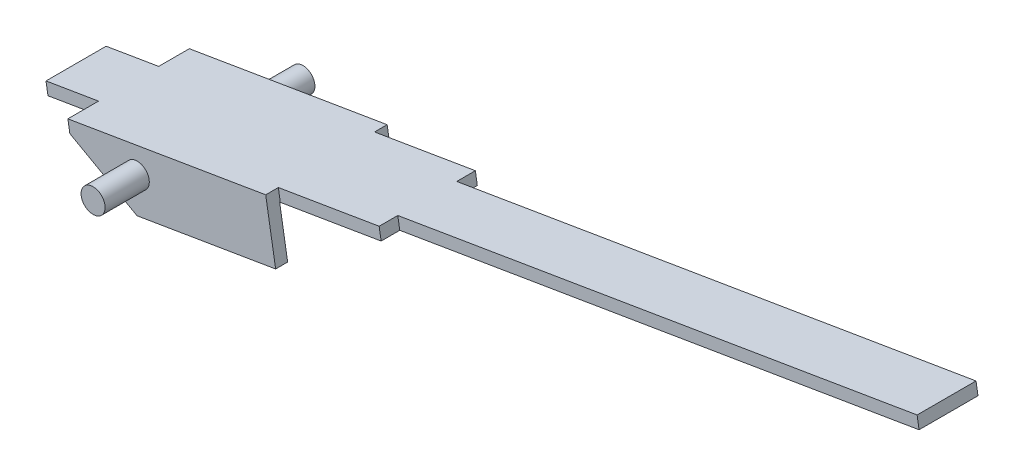
ISO-10303-21;
HEADER;
FILE_DESCRIPTION(('STEP AP214'),'2;1');
FILE_NAME('part.step','',(''),(''),'','','');
FILE_SCHEMA(('AUTOMOTIVE_DESIGN { 1 0 10303 214 1 1 1 1 }'));
ENDSEC;
DATA;
#1=APPLICATION_CONTEXT('core data for automotive mechanical design processes');
#2=APPLICATION_PROTOCOL_DEFINITION('international standard','automotive_design',2000,#1);
#3=PRODUCT_CONTEXT('',#1,'mechanical');
#4=PRODUCT('Part','Part','',(#3));
#5=PRODUCT_RELATED_PRODUCT_CATEGORY('part','',(#4));
#6=PRODUCT_DEFINITION_FORMATION('','',#4);
#7=PRODUCT_DEFINITION_CONTEXT('part definition',#1,'design');
#8=PRODUCT_DEFINITION('design','',#6,#7);
#9=PRODUCT_DEFINITION_SHAPE('','',#8);
#10=(LENGTH_UNIT() NAMED_UNIT(*) SI_UNIT(.MILLI.,.METRE.));
#11=(NAMED_UNIT(*) PLANE_ANGLE_UNIT() SI_UNIT($,.RADIAN.));
#12=(NAMED_UNIT(*) SI_UNIT($,.STERADIAN.) SOLID_ANGLE_UNIT());
#13=UNCERTAINTY_MEASURE_WITH_UNIT(LENGTH_MEASURE(1.E-05),#10,'distance_accuracy_value','');
#14=(GEOMETRIC_REPRESENTATION_CONTEXT(3) GLOBAL_UNCERTAINTY_ASSIGNED_CONTEXT((#13)) GLOBAL_UNIT_ASSIGNED_CONTEXT((#10,
#11,#12)) REPRESENTATION_CONTEXT('',''));
#15=CARTESIAN_POINT('',(0.,0.,0.));
#16=DIRECTION('',(0.,0.,1.));
#17=DIRECTION('',(1.,0.,0.));
#18=AXIS2_PLACEMENT_3D('',#15,#16,#17);
#19=CARTESIAN_POINT('',(63.0735162002673,7.61456197917017,5.05));
#20=DIRECTION('',(-0.165047605860671,0.986285601537233,0.));
#21=DIRECTION('',(-0.986285601537233,-0.165047605860671,0.));
#22=AXIS2_PLACEMENT_3D('',#19,#20,#21);
#23=PLANE('',#22);
#24=DIRECTION('',(0.986285601537233,0.165047605860671,0.));
#25=VECTOR('',#24,1.);
#26=CARTESIAN_POINT('',(63.0735162002673,7.61456197917017,5.05));
#27=LINE('',#26,#25);
#28=CARTESIAN_POINT('',(-0.0145047437726756,-2.94275204738829,5.05));
#29=VERTEX_POINT('',#28);
#30=CARTESIAN_POINT('',(11.5053110821822,-1.01499601093565,5.05));
#31=VERTEX_POINT('',#30);
#32=EDGE_CURVE('E175',#29,#31,#27,.T.);
#33=ORIENTED_EDGE('',*,*,#32,.F.);
#34=DIRECTION('',(0.,0.,1.));
#35=VECTOR('',#34,1.);
#36=CARTESIAN_POINT('',(-0.0145047437726756,-2.94275204738829,-8.725));
#37=LINE('',#36,#35);
#38=CARTESIAN_POINT('',(-0.0145047437726756,-2.94275204738829,4.05));
#39=VERTEX_POINT('',#38);
#40=EDGE_CURVE('E158',#39,#29,#37,.T.);
#41=ORIENTED_EDGE('',*,*,#40,.F.);
#42=DIRECTION('',(-0.986285601537233,-0.165047605860671,0.));
#43=VECTOR('',#42,1.);
#44=CARTESIAN_POINT('',(71.9834480449746,9.105573220801,4.05));
#45=LINE('',#44,#43);
#46=CARTESIAN_POINT('',(11.5053110821822,-1.01499601093568,4.05));
#47=VERTEX_POINT('',#46);
#48=EDGE_CURVE('E396',#47,#39,#45,.T.);
#49=ORIENTED_EDGE('',*,*,#48,.F.);
#50=DIRECTION('',(0.,0.,1.));
#51=VECTOR('',#50,1.);
#52=CARTESIAN_POINT('',(11.5053110821822,-1.01499601093565,5.05));
#53=LINE('',#52,#51);
#54=EDGE_CURVE('E181',#47,#31,#53,.T.);
#55=ORIENTED_EDGE('',*,*,#54,.T.);
#56=EDGE_LOOP('',(#33,#41,#49,#55));
#57=FACE_BOUND('',#56,.T.);
#58=ADVANCED_FACE('F16',(#57),#23,.F.);
#59=CARTESIAN_POINT('',(63.0735162002673,7.61456197917017,5.05));
#60=DIRECTION('',(0.,0.,-1.));
#61=DIRECTION('',(-1.,0.,0.));
#62=AXIS2_PLACEMENT_3D('',#59,#60,#61);
#63=PLANE('',#62);
#64=DIRECTION('',(0.165047605860671,-0.986285601537232,0.));
#65=VECTOR('',#64,1.);
#66=CARTESIAN_POINT('',(-4.94593275145883,-3.76799007669166,5.05));
#67=LINE('',#66,#65);
#68=CARTESIAN_POINT('',(-5.77117078076219,1.1634379309945,5.05));
#69=VERTEX_POINT('',#68);
#70=CARTESIAN_POINT('',(-5.60612317490151,0.177152329457265,5.05));
#71=VERTEX_POINT('',#70);
#72=EDGE_CURVE('E178',#69,#71,#67,.T.);
#73=ORIENTED_EDGE('',*,*,#72,.T.);
#74=DIRECTION('',(-0.873264085435059,0.487247203264699,0.));
#75=VECTOR('',#74,1.);
#76=CARTESIAN_POINT('',(-5.60612317490151,0.177152329457265,5.05));
#77=LINE('',#76,#75);
#78=EDGE_CURVE('E161',#29,#71,#77,.T.);
#79=ORIENTED_EDGE('',*,*,#78,.F.);
#80=ORIENTED_EDGE('',*,*,#32,.T.);
#81=DIRECTION('',(-0.165047605860671,0.986285601537232,0.));
#82=VECTOR('',#81,1.);
#83=CARTESIAN_POINT('',(11.5053110821822,-1.01499601093566,5.05));
#84=LINE('',#83,#82);
#85=CARTESIAN_POINT('',(10.6800730528788,3.9164319967505,5.05));
#86=VERTEX_POINT('',#85);
#87=EDGE_CURVE('E201',#31,#86,#84,.T.);
#88=ORIENTED_EDGE('',*,*,#87,.T.);
#89=DIRECTION('',(-0.986285601537232,-0.165047605860671,0.));
#90=VECTOR('',#89,1.);
#91=CARTESIAN_POINT('',(-10.1404159955721,0.432277037031721,5.05));
#92=LINE('',#91,#90);
#93=EDGE_CURVE('E184',#86,#69,#92,.T.);
#94=ORIENTED_EDGE('',*,*,#93,.T.);
#95=EDGE_LOOP('',(#73,#79,#80,#88,#94));
#96=FACE_BOUND('',#95,.T.);
#97=CARTESIAN_POINT('',(0.,0.,5.05));
#98=DIRECTION('',(0.,0.,-1.));
#99=DIRECTION('',(-1.,0.,0.));
#100=AXIS2_PLACEMENT_3D('',#97,#98,#99);
#101=CIRCLE('',#100,1.);
#102=CARTESIAN_POINT('',(-1.,0.,5.05));
#103=VERTEX_POINT('',#102);
#104=EDGE_CURVE('E203',#103,#103,#101,.F.);
#105=ORIENTED_EDGE('',*,*,#104,.F.);
#106=EDGE_LOOP('',(#105));
#107=FACE_BOUND('',#106,.T.);
#108=ADVANCED_FACE('F172',(#96,#107),#63,.F.);
#109=CARTESIAN_POINT('',(63.0735162002673,7.61456197917017,-5.05));
#110=DIRECTION('',(0.,0.,-1.));
#111=DIRECTION('',(-1.,0.,0.));
#112=AXIS2_PLACEMENT_3D('',#109,#110,#111);
#113=PLANE('',#112);
#114=DIRECTION('',(0.873264085435059,-0.487247203264699,0.));
#115=VECTOR('',#114,1.);
#116=CARTESIAN_POINT('',(43.6037099911584,-27.2800098087746,-5.05));
#117=LINE('',#116,#115);
#118=CARTESIAN_POINT('',(-5.60612317490151,0.177152329457265,-5.05));
#119=VERTEX_POINT('',#118);
#120=CARTESIAN_POINT('',(-0.0145047437726756,-2.94275204738829,-5.05));
#121=VERTEX_POINT('',#120);
#122=EDGE_CURVE('E407',#119,#121,#117,.T.);
#123=ORIENTED_EDGE('',*,*,#122,.F.);
#124=DIRECTION('',(0.165047605860671,-0.986285601537232,0.));
#125=VECTOR('',#124,1.);
#126=CARTESIAN_POINT('',(-4.94593275145883,-3.76799007669166,-5.05));
#127=LINE('',#126,#125);
#128=CARTESIAN_POINT('',(-5.77117078076218,1.1634379309945,-5.05));
#129=VERTEX_POINT('',#128);
#130=EDGE_CURVE('E197',#129,#119,#127,.T.);
#131=ORIENTED_EDGE('',*,*,#130,.F.);
#132=DIRECTION('',(-0.986285601537232,-0.165047605860671,0.));
#133=VECTOR('',#132,1.);
#134=CARTESIAN_POINT('',(-10.1404159955721,0.432277037031721,-5.05));
#135=LINE('',#134,#133);
#136=CARTESIAN_POINT('',(10.6800730528788,3.9164319967505,-5.05));
#137=VERTEX_POINT('',#136);
#138=EDGE_CURVE('E278',#137,#129,#135,.T.);
#139=ORIENTED_EDGE('',*,*,#138,.F.);
#140=DIRECTION('',(-0.165047605860671,0.986285601537232,0.));
#141=VECTOR('',#140,1.);
#142=CARTESIAN_POINT('',(11.5053110821822,-1.01499601093566,-5.05));
#143=LINE('',#142,#141);
#144=CARTESIAN_POINT('',(11.5053110821822,-1.01499601093565,-5.05));
#145=VERTEX_POINT('',#144);
#146=EDGE_CURVE('E195',#145,#137,#143,.T.);
#147=ORIENTED_EDGE('',*,*,#146,.F.);
#148=DIRECTION('',(0.986285601537233,0.165047605860671,0.));
#149=VECTOR('',#148,1.);
#150=CARTESIAN_POINT('',(63.0735162002673,7.61456197917017,-5.05));
#151=LINE('',#150,#149);
#152=EDGE_CURVE('E189',#121,#145,#151,.T.);
#153=ORIENTED_EDGE('',*,*,#152,.F.);
#154=EDGE_LOOP('',(#123,#131,#139,#147,#153));
#155=FACE_BOUND('',#154,.T.);
#156=CARTESIAN_POINT('',(0.,0.,-5.05));
#157=DIRECTION('',(0.,0.,-1.));
#158=DIRECTION('',(-1.,0.,0.));
#159=AXIS2_PLACEMENT_3D('',#156,#157,#158);
#160=CIRCLE('',#159,1.);
#161=CARTESIAN_POINT('',(-1.,0.,-5.05));
#162=VERTEX_POINT('',#161);
#163=EDGE_CURVE('E204',#162,#162,#160,.F.);
#164=ORIENTED_EDGE('',*,*,#163,.T.);
#165=EDGE_LOOP('',(#164));
#166=FACE_BOUND('',#165,.T.);
#167=ADVANCED_FACE('F295',(#155,#166),#113,.T.);
#168=CARTESIAN_POINT('',(62.2482781709639,12.5459899868563,5.05));
#169=DIRECTION('',(-0.986285601537233,-0.16504760586067,0.));
#170=DIRECTION('',(0.16504760586067,-0.986285601537233,0.));
#171=AXIS2_PLACEMENT_3D('',#168,#169,#170);
#172=PLANE('',#171);
#173=DIRECTION('',(-0.165047605860671,0.986285601537232,0.));
#174=VECTOR('',#173,1.);
#175=CARTESIAN_POINT('',(65.0454357846163,-4.16916480251072,2.45));
#176=LINE('',#175,#174);
#177=CARTESIAN_POINT('',(62.4133257768246,11.5597043853191,2.45));
#178=VERTEX_POINT('',#177);
#179=CARTESIAN_POINT('',(62.2482781709639,12.5459899868563,2.45));
#180=VERTEX_POINT('',#179);
#181=EDGE_CURVE('E227',#178,#180,#176,.T.);
#182=ORIENTED_EDGE('',*,*,#181,.F.);
#183=DIRECTION('',(0.,0.,1.));
#184=VECTOR('',#183,1.);
#185=CARTESIAN_POINT('',(62.4133257768246,11.5597043853191,4.05));
#186=LINE('',#185,#184);
#187=CARTESIAN_POINT('',(62.4133257768246,11.5597043853191,-2.45));
#188=VERTEX_POINT('',#187);
#189=EDGE_CURVE('E394',#188,#178,#186,.T.);
#190=ORIENTED_EDGE('',*,*,#189,.F.);
#191=DIRECTION('',(-0.165047605860671,0.986285601537232,0.));
#192=VECTOR('',#191,1.);
#193=CARTESIAN_POINT('',(65.0454357846163,-4.16916480251072,-2.45));
#194=LINE('',#193,#192);
#195=CARTESIAN_POINT('',(62.2482781709639,12.5459899868563,-2.45));
#196=VERTEX_POINT('',#195);
#197=EDGE_CURVE('E268',#188,#196,#194,.T.);
#198=ORIENTED_EDGE('',*,*,#197,.T.);
#199=DIRECTION('',(0.,0.,-1.));
#200=VECTOR('',#199,1.);
#201=CARTESIAN_POINT('',(62.2482781709639,12.5459899868563,5.05));
#202=LINE('',#201,#200);
#203=EDGE_CURVE('E187',#180,#196,#202,.T.);
#204=ORIENTED_EDGE('',*,*,#203,.F.);
#205=EDGE_LOOP('',(#182,#190,#198,#204));
#206=FACE_BOUND('',#205,.T.);
#207=ADVANCED_FACE('F18',(#206),#172,.F.);
#208=CARTESIAN_POINT('',(-10.1404159955721,0.432277037031721,5.05));
#209=DIRECTION('',(0.165047605860671,-0.986285601537232,0.));
#210=DIRECTION('',(0.986285601537233,0.165047605860671,0.));
#211=AXIS2_PLACEMENT_3D('',#208,#209,#210);
#212=PLANE('',#211);
#213=ORIENTED_EDGE('',*,*,#93,.F.);
#214=DIRECTION('',(0.,0.,1.));
#215=VECTOR('',#214,1.);
#216=CARTESIAN_POINT('',(10.6800730528788,3.9164319967505,4.));
#217=LINE('',#216,#215);
#218=CARTESIAN_POINT('',(10.6800730528788,3.9164319967505,4.));
#219=VERTEX_POINT('',#218);
#220=EDGE_CURVE('E225',#219,#86,#217,.T.);
#221=ORIENTED_EDGE('',*,*,#220,.F.);
#222=DIRECTION('',(-0.986285601537233,-0.165047605860671,0.));
#223=VECTOR('',#222,1.);
#224=CARTESIAN_POINT('',(19.0635006659453,5.3193366465662,4.));
#225=LINE('',#224,#223);
#226=CARTESIAN_POINT('',(19.0635006659453,5.3193366465662,4.));
#227=VERTEX_POINT('',#226);
#228=EDGE_CURVE('E222',#227,#219,#225,.T.);
#229=ORIENTED_EDGE('',*,*,#228,.F.);
#230=DIRECTION('',(0.,0.,1.));
#231=VECTOR('',#230,1.);
#232=CARTESIAN_POINT('',(19.0635006659453,5.3193366465662,2.45));
#233=LINE('',#232,#231);
#234=CARTESIAN_POINT('',(19.0635006659453,5.3193366465662,2.45));
#235=VERTEX_POINT('',#234);
#236=EDGE_CURVE('E219',#235,#227,#233,.T.);
#237=ORIENTED_EDGE('',*,*,#236,.F.);
#238=DIRECTION('',(-0.986285601537232,-0.165047605860671,0.));
#239=VECTOR('',#238,1.);
#240=CARTESIAN_POINT('',(62.2482781709639,12.5459899868563,2.45));
#241=LINE('',#240,#239);
#242=EDGE_CURVE('E206',#180,#235,#241,.T.);
#243=ORIENTED_EDGE('',*,*,#242,.F.);
#244=ORIENTED_EDGE('',*,*,#203,.T.);
#245=DIRECTION('',(0.986285601537232,0.165047605860671,0.));
#246=VECTOR('',#245,1.);
#247=CARTESIAN_POINT('',(62.2482781709639,12.5459899868563,-2.45));
#248=LINE('',#247,#246);
#249=CARTESIAN_POINT('',(19.0635006659453,5.3193366465662,-2.45));
#250=VERTEX_POINT('',#249);
#251=EDGE_CURVE('E264',#250,#196,#248,.T.);
#252=ORIENTED_EDGE('',*,*,#251,.F.);
#253=DIRECTION('',(0.,0.,1.));
#254=VECTOR('',#253,1.);
#255=CARTESIAN_POINT('',(19.0635006659453,5.3193366465662,-2.45));
#256=LINE('',#255,#254);
#257=CARTESIAN_POINT('',(19.0635006659453,5.3193366465662,-4.));
#258=VERTEX_POINT('',#257);
#259=EDGE_CURVE('E261',#258,#250,#256,.T.);
#260=ORIENTED_EDGE('',*,*,#259,.F.);
#261=DIRECTION('',(0.986285601537233,0.165047605860671,0.));
#262=VECTOR('',#261,1.);
#263=CARTESIAN_POINT('',(19.0635006659453,5.3193366465662,-4.));
#264=LINE('',#263,#262);
#265=CARTESIAN_POINT('',(10.6800730528788,3.9164319967505,-4.));
#266=VERTEX_POINT('',#265);
#267=EDGE_CURVE('E258',#266,#258,#264,.T.);
#268=ORIENTED_EDGE('',*,*,#267,.F.);
#269=DIRECTION('',(0.,0.,1.));
#270=VECTOR('',#269,1.);
#271=CARTESIAN_POINT('',(10.6800730528788,3.9164319967505,-4.));
#272=LINE('',#271,#270);
#273=EDGE_CURVE('E254',#137,#266,#272,.T.);
#274=ORIENTED_EDGE('',*,*,#273,.F.);
#275=ORIENTED_EDGE('',*,*,#138,.T.);
#276=DIRECTION('',(0.,0.,-1.));
#277=VECTOR('',#276,1.);
#278=CARTESIAN_POINT('',(-5.77117078076219,1.1634379309945,-2.5));
#279=LINE('',#278,#277);
#280=CARTESIAN_POINT('',(-5.77117078076219,1.1634379309945,-2.5));
#281=VERTEX_POINT('',#280);
#282=EDGE_CURVE('E249',#281,#129,#279,.T.);
#283=ORIENTED_EDGE('',*,*,#282,.F.);
#284=DIRECTION('',(0.986285601537233,0.165047605860671,0.));
#285=VECTOR('',#284,1.);
#286=CARTESIAN_POINT('',(-5.77117078076219,1.1634379309945,-2.5));
#287=LINE('',#286,#285);
#288=CARTESIAN_POINT('',(-10.1404159955721,0.432277037031723,-2.5));
#289=VERTEX_POINT('',#288);
#290=EDGE_CURVE('E245',#289,#281,#287,.T.);
#291=ORIENTED_EDGE('',*,*,#290,.F.);
#292=DIRECTION('',(0.,0.,-1.));
#293=VECTOR('',#292,1.);
#294=CARTESIAN_POINT('',(-10.1404159955721,0.432277037031721,5.05));
#295=LINE('',#294,#293);
#296=CARTESIAN_POINT('',(-10.1404159955721,0.432277037031723,2.5));
#297=VERTEX_POINT('',#296);
#298=EDGE_CURVE('E183',#297,#289,#295,.T.);
#299=ORIENTED_EDGE('',*,*,#298,.F.);
#300=DIRECTION('',(-0.986285601537233,-0.165047605860671,0.));
#301=VECTOR('',#300,1.);
#302=CARTESIAN_POINT('',(-5.77117078076219,1.1634379309945,2.5));
#303=LINE('',#302,#301);
#304=CARTESIAN_POINT('',(-5.77117078076219,1.1634379309945,2.5));
#305=VERTEX_POINT('',#304);
#306=EDGE_CURVE('E239',#305,#297,#303,.T.);
#307=ORIENTED_EDGE('',*,*,#306,.F.);
#308=DIRECTION('',(0.,0.,-1.));
#309=VECTOR('',#308,1.);
#310=CARTESIAN_POINT('',(-5.77117078076219,1.1634379309945,5.05));
#311=LINE('',#310,#309);
#312=EDGE_CURVE('E236',#69,#305,#311,.T.);
#313=ORIENTED_EDGE('',*,*,#312,.F.);
#314=EDGE_LOOP('',(#213,#221,#229,#237,#243,#244,#252,#260,#268,#274,#275,#283,#291,#299,#307,#313));
#315=FACE_BOUND('',#314,.T.);
#316=ADVANCED_FACE('F301',(#315),#212,.F.);
#317=CARTESIAN_POINT('',(-9.31517796626878,-4.49915097065442,5.05));
#318=DIRECTION('',(0.986285601537233,0.165047605860671,0.));
#319=DIRECTION('',(-0.165047605860671,0.986285601537233,0.));
#320=AXIS2_PLACEMENT_3D('',#317,#318,#319);
#321=PLANE('',#320);
#322=DIRECTION('',(-0.165047605860671,0.986285601537232,0.));
#323=VECTOR('',#322,1.);
#324=CARTESIAN_POINT('',(-7.34325838191977,-16.2828777523354,-2.5));
#325=LINE('',#324,#323);
#326=CARTESIAN_POINT('',(-9.97536838971146,-0.554008564505507,-2.5));
#327=VERTEX_POINT('',#326);
#328=EDGE_CURVE('E251',#327,#289,#325,.T.);
#329=ORIENTED_EDGE('',*,*,#328,.F.);
#330=DIRECTION('',(0.,0.,-1.));
#331=VECTOR('',#330,1.);
#332=CARTESIAN_POINT('',(-9.97536838971146,-0.554008564505507,4.05));
#333=LINE('',#332,#331);
#334=CARTESIAN_POINT('',(-9.97536838971146,-0.554008564505507,2.5));
#335=VERTEX_POINT('',#334);
#336=EDGE_CURVE('E369',#335,#327,#333,.T.);
#337=ORIENTED_EDGE('',*,*,#336,.F.);
#338=DIRECTION('',(-0.165047605860671,0.986285601537232,0.));
#339=VECTOR('',#338,1.);
#340=CARTESIAN_POINT('',(-7.34325838191977,-16.2828777523354,2.5));
#341=LINE('',#340,#339);
#342=EDGE_CURVE('E243',#335,#297,#341,.T.);
#343=ORIENTED_EDGE('',*,*,#342,.T.);
#344=ORIENTED_EDGE('',*,*,#298,.T.);
#345=EDGE_LOOP('',(#329,#337,#343,#344));
#346=FACE_BOUND('',#345,.T.);
#347=ADVANCED_FACE('F355',(#346),#321,.F.);
#348=DIRECTION('',(-0.986285601537233,-0.165047605860671,0.));
#349=VECTOR('',#348,1.);
#350=CARTESIAN_POINT('',(71.9834480449746,9.105573220801,-4.05));
#351=LINE('',#350,#349);
#352=CARTESIAN_POINT('',(11.5053110821822,-1.01499601093568,-4.05));
#353=VERTEX_POINT('',#352);
#354=CARTESIAN_POINT('',(-0.0145047437726808,-2.94275204738832,-4.05));
#355=VERTEX_POINT('',#354);
#356=EDGE_CURVE('E403',#353,#355,#351,.T.);
#357=ORIENTED_EDGE('',*,*,#356,.T.);
#358=EDGE_CURVE('E31',#121,#355,#37,.T.);
#359=ORIENTED_EDGE('',*,*,#358,.F.);
#360=ORIENTED_EDGE('',*,*,#152,.T.);
#361=DIRECTION('',(0.,0.,1.));
#362=VECTOR('',#361,1.);
#363=CARTESIAN_POINT('',(11.5053110821822,-1.01499601093565,5.05));
#364=LINE('',#363,#362);
#365=EDGE_CURVE('E270',#145,#353,#364,.T.);
#366=ORIENTED_EDGE('',*,*,#365,.T.);
#367=EDGE_LOOP('',(#357,#359,#360,#366));
#368=FACE_BOUND('',#367,.T.);
#369=ADVANCED_FACE('F284',(#368),#23,.F.);
#370=CARTESIAN_POINT('',(65.0454357846163,-4.16916480251072,-2.45));
#371=DIRECTION('',(0.,0.,1.));
#372=DIRECTION('',(1.,0.,0.));
#373=AXIS2_PLACEMENT_3D('',#370,#371,#372);
#374=PLANE('',#373);
#375=ORIENTED_EDGE('',*,*,#197,.F.);
#376=DIRECTION('',(-0.986285601537233,-0.165047605860671,0.));
#377=VECTOR('',#376,1.);
#378=CARTESIAN_POINT('',(62.4133257768246,11.5597043853191,-2.45));
#379=LINE('',#378,#377);
#380=CARTESIAN_POINT('',(19.228548271806,4.33305104502895,-2.45));
#381=VERTEX_POINT('',#380);
#382=EDGE_CURVE('E315',#188,#381,#379,.T.);
#383=ORIENTED_EDGE('',*,*,#382,.T.);
#384=DIRECTION('',(-0.165047605860671,0.986285601537232,0.));
#385=VECTOR('',#384,1.);
#386=CARTESIAN_POINT('',(21.8606582795977,-11.3958181428008,-2.45));
#387=LINE('',#386,#385);
#388=EDGE_CURVE('E271',#381,#250,#387,.T.);
#389=ORIENTED_EDGE('',*,*,#388,.T.);
#390=ORIENTED_EDGE('',*,*,#251,.T.);
#391=EDGE_LOOP('',(#375,#383,#389,#390));
#392=FACE_BOUND('',#391,.T.);
#393=ADVANCED_FACE('F354',(#392),#374,.F.);
#394=CARTESIAN_POINT('',(21.8606582795977,-11.3958181428008,-2.45));
#395=DIRECTION('',(-0.986285601537232,-0.165047605860671,0.));
#396=DIRECTION('',(0.165047605860671,-0.986285601537232,0.));
#397=AXIS2_PLACEMENT_3D('',#394,#395,#396);
#398=PLANE('',#397);
#399=ORIENTED_EDGE('',*,*,#388,.F.);
#400=DIRECTION('',(0.,0.,-1.));
#401=VECTOR('',#400,1.);
#402=CARTESIAN_POINT('',(19.228548271806,4.33305104502895,-2.45));
#403=LINE('',#402,#401);
#404=CARTESIAN_POINT('',(19.228548271806,4.33305104502895,-4.));
#405=VERTEX_POINT('',#404);
#406=EDGE_CURVE('E313',#381,#405,#403,.T.);
#407=ORIENTED_EDGE('',*,*,#406,.T.);
#408=DIRECTION('',(-0.165047605860671,0.986285601537232,0.));
#409=VECTOR('',#408,1.);
#410=CARTESIAN_POINT('',(21.8606582795977,-11.3958181428008,-4.));
#411=LINE('',#410,#409);
#412=EDGE_CURVE('E273',#405,#258,#411,.T.);
#413=ORIENTED_EDGE('',*,*,#412,.T.);
#414=ORIENTED_EDGE('',*,*,#259,.T.);
#415=EDGE_LOOP('',(#399,#407,#413,#414));
#416=FACE_BOUND('',#415,.T.);
#417=ADVANCED_FACE('F360',(#416),#398,.F.);
#418=CARTESIAN_POINT('',(21.8606582795977,-11.3958181428008,-4.));
#419=DIRECTION('',(0.,0.,1.));
#420=DIRECTION('',(1.,0.,0.));
#421=AXIS2_PLACEMENT_3D('',#418,#419,#420);
#422=PLANE('',#421);
#423=ORIENTED_EDGE('',*,*,#412,.F.);
#424=DIRECTION('',(-0.986285601537233,-0.165047605860671,0.));
#425=VECTOR('',#424,1.);
#426=CARTESIAN_POINT('',(19.228548271806,4.33305104502895,-4.));
#427=LINE('',#426,#425);
#428=CARTESIAN_POINT('',(10.8451206587395,2.93014639521326,-4.));
#429=VERTEX_POINT('',#428);
#430=EDGE_CURVE('E311',#405,#429,#427,.T.);
#431=ORIENTED_EDGE('',*,*,#430,.T.);
#432=DIRECTION('',(-0.165047605860671,0.986285601537232,0.));
#433=VECTOR('',#432,1.);
#434=CARTESIAN_POINT('',(13.4772306665312,-12.7987227926166,-4.));
#435=LINE('',#434,#433);
#436=EDGE_CURVE('E267',#429,#266,#435,.T.);
#437=ORIENTED_EDGE('',*,*,#436,.T.);
#438=ORIENTED_EDGE('',*,*,#267,.T.);
#439=EDGE_LOOP('',(#423,#431,#437,#438));
#440=FACE_BOUND('',#439,.T.);
#441=ADVANCED_FACE('F310',(#440),#422,.F.);
#442=CARTESIAN_POINT('',(13.4772306665312,-12.7987227926166,-4.));
#443=DIRECTION('',(-0.986285601537232,-0.165047605860671,0.));
#444=DIRECTION('',(0.165047605860671,-0.986285601537232,0.));
#445=AXIS2_PLACEMENT_3D('',#442,#443,#444);
#446=PLANE('',#445);
#447=DIRECTION('',(0.,0.,-1.));
#448=VECTOR('',#447,1.);
#449=CARTESIAN_POINT('',(10.8451206587395,2.93014639521326,-4.));
#450=LINE('',#449,#448);
#451=CARTESIAN_POINT('',(10.8451206587395,2.93014639521326,-4.05));
#452=VERTEX_POINT('',#451);
#453=EDGE_CURVE('E306',#429,#452,#450,.T.);
#454=ORIENTED_EDGE('',*,*,#453,.T.);
#455=DIRECTION('',(0.165047605860671,-0.986285601537233,0.));
#456=VECTOR('',#455,1.);
#457=CARTESIAN_POINT('',(13.4772306665312,-12.7987227926166,-4.05));
#458=LINE('',#457,#456);
#459=EDGE_CURVE('E293',#452,#353,#458,.T.);
#460=ORIENTED_EDGE('',*,*,#459,.T.);
#461=ORIENTED_EDGE('',*,*,#365,.F.);
#462=ORIENTED_EDGE('',*,*,#146,.T.);
#463=ORIENTED_EDGE('',*,*,#273,.T.);
#464=ORIENTED_EDGE('',*,*,#436,.F.);
#465=EDGE_LOOP('',(#454,#460,#461,#462,#463,#464));
#466=FACE_BOUND('',#465,.T.);
#467=ADVANCED_FACE('F291',(#466),#446,.F.);
#468=CARTESIAN_POINT('',(-2.97401316710982,-15.5517168583725,-2.5));
#469=DIRECTION('',(0.,0.,1.));
#470=DIRECTION('',(1.,0.,0.));
#471=AXIS2_PLACEMENT_3D('',#468,#469,#470);
#472=PLANE('',#471);
#473=DIRECTION('',(-0.165047605860671,0.986285601537232,0.));
#474=VECTOR('',#473,1.);
#475=CARTESIAN_POINT('',(-2.97401316710982,-15.5517168583725,-2.5));
#476=LINE('',#475,#474);
#477=CARTESIAN_POINT('',(-5.60612317490152,0.177152329457267,-2.5));
#478=VERTEX_POINT('',#477);
#479=EDGE_CURVE('E252',#478,#281,#476,.T.);
#480=ORIENTED_EDGE('',*,*,#479,.F.);
#481=DIRECTION('',(-0.986285601537233,-0.165047605860671,0.));
#482=VECTOR('',#481,1.);
#483=CARTESIAN_POINT('',(-5.60612317490151,0.177152329457267,-2.5));
#484=LINE('',#483,#482);
#485=EDGE_CURVE('E317',#478,#327,#484,.T.);
#486=ORIENTED_EDGE('',*,*,#485,.T.);
#487=ORIENTED_EDGE('',*,*,#328,.T.);
#488=ORIENTED_EDGE('',*,*,#290,.T.);
#489=EDGE_LOOP('',(#480,#486,#487,#488));
#490=FACE_BOUND('',#489,.T.);
#491=ADVANCED_FACE('F375',(#490),#472,.F.);
#492=CARTESIAN_POINT('',(-2.97401316710982,-15.5517168583725,-2.5));
#493=DIRECTION('',(0.986285601537232,0.165047605860671,0.));
#494=DIRECTION('',(-0.165047605860671,0.986285601537232,0.));
#495=AXIS2_PLACEMENT_3D('',#492,#493,#494);
#496=PLANE('',#495);
#497=ORIENTED_EDGE('',*,*,#130,.T.);
#498=DIRECTION('',(0.,0.,1.));
#499=VECTOR('',#498,1.);
#500=CARTESIAN_POINT('',(-5.60612317490151,0.177152329457265,-8.725));
#501=LINE('',#500,#499);
#502=CARTESIAN_POINT('',(-5.60612317490151,0.177152329457265,-4.05));
#503=VERTEX_POINT('',#502);
#504=EDGE_CURVE('E411',#119,#503,#501,.T.);
#505=ORIENTED_EDGE('',*,*,#504,.T.);
#506=DIRECTION('',(0.,0.,1.));
#507=VECTOR('',#506,1.);
#508=CARTESIAN_POINT('',(-5.60612317490152,0.177152329457267,-2.5));
#509=LINE('',#508,#507);
#510=EDGE_CURVE('E378',#503,#478,#509,.T.);
#511=ORIENTED_EDGE('',*,*,#510,.T.);
#512=ORIENTED_EDGE('',*,*,#479,.T.);
#513=ORIENTED_EDGE('',*,*,#282,.T.);
#514=EDGE_LOOP('',(#497,#505,#511,#512,#513));
#515=FACE_BOUND('',#514,.T.);
#516=ADVANCED_FACE('F417',(#515),#496,.F.);
#517=CARTESIAN_POINT('',(-2.97401316710982,-15.5517168583725,2.5));
#518=DIRECTION('',(0.,0.,-1.));
#519=DIRECTION('',(-1.,0.,0.));
#520=AXIS2_PLACEMENT_3D('',#517,#518,#519);
#521=PLANE('',#520);
#522=ORIENTED_EDGE('',*,*,#342,.F.);
#523=DIRECTION('',(0.986285601537233,0.165047605860671,0.));
#524=VECTOR('',#523,1.);
#525=CARTESIAN_POINT('',(-5.60612317490151,0.177152329457267,2.5));
#526=LINE('',#525,#524);
#527=CARTESIAN_POINT('',(-5.60612317490152,0.177152329457267,2.5));
#528=VERTEX_POINT('',#527);
#529=EDGE_CURVE('E379',#335,#528,#526,.T.);
#530=ORIENTED_EDGE('',*,*,#529,.T.);
#531=DIRECTION('',(-0.165047605860671,0.986285601537232,0.));
#532=VECTOR('',#531,1.);
#533=CARTESIAN_POINT('',(-2.97401316710982,-15.5517168583725,2.5));
#534=LINE('',#533,#532);
#535=EDGE_CURVE('E242',#528,#305,#534,.T.);
#536=ORIENTED_EDGE('',*,*,#535,.T.);
#537=ORIENTED_EDGE('',*,*,#306,.T.);
#538=EDGE_LOOP('',(#522,#530,#536,#537));
#539=FACE_BOUND('',#538,.T.);
#540=ADVANCED_FACE('F458',(#539),#521,.F.);
#541=CARTESIAN_POINT('',(-2.97401316710982,-15.5517168583725,5.05));
#542=DIRECTION('',(0.986285601537232,0.165047605860671,0.));
#543=DIRECTION('',(-0.165047605860671,0.986285601537232,0.));
#544=AXIS2_PLACEMENT_3D('',#541,#542,#543);
#545=PLANE('',#544);
#546=DIRECTION('',(0.,0.,1.));
#547=VECTOR('',#546,1.);
#548=CARTESIAN_POINT('',(-5.60612317490152,0.177152329457267,5.05));
#549=LINE('',#548,#547);
#550=CARTESIAN_POINT('',(-5.60612317490151,0.177152329457267,4.05));
#551=VERTEX_POINT('',#550);
#552=EDGE_CURVE('E384',#528,#551,#549,.T.);
#553=ORIENTED_EDGE('',*,*,#552,.T.);
#554=EDGE_CURVE('E413',#551,#71,#501,.T.);
#555=ORIENTED_EDGE('',*,*,#554,.T.);
#556=ORIENTED_EDGE('',*,*,#72,.F.);
#557=ORIENTED_EDGE('',*,*,#312,.T.);
#558=ORIENTED_EDGE('',*,*,#535,.F.);
#559=EDGE_LOOP('',(#553,#555,#556,#557,#558));
#560=FACE_BOUND('',#559,.T.);
#561=ADVANCED_FACE('F453',(#560),#545,.F.);
#562=CARTESIAN_POINT('',(21.8606582795977,-11.3958181428008,4.));
#563=DIRECTION('',(0.,0.,-1.));
#564=DIRECTION('',(-1.,0.,0.));
#565=AXIS2_PLACEMENT_3D('',#562,#563,#564);
#566=PLANE('',#565);
#567=DIRECTION('',(-0.165047605860671,0.986285601537232,0.));
#568=VECTOR('',#567,1.);
#569=CARTESIAN_POINT('',(13.4772306665312,-12.7987227926166,4.));
#570=LINE('',#569,#568);
#571=CARTESIAN_POINT('',(10.8451206587395,2.93014639521326,4.));
#572=VERTEX_POINT('',#571);
#573=EDGE_CURVE('E228',#572,#219,#570,.T.);
#574=ORIENTED_EDGE('',*,*,#573,.F.);
#575=DIRECTION('',(0.986285601537233,0.165047605860671,0.));
#576=VECTOR('',#575,1.);
#577=CARTESIAN_POINT('',(19.228548271806,4.33305104502895,4.));
#578=LINE('',#577,#576);
#579=CARTESIAN_POINT('',(19.228548271806,4.33305104502895,4.));
#580=VERTEX_POINT('',#579);
#581=EDGE_CURVE('E39',#572,#580,#578,.T.);
#582=ORIENTED_EDGE('',*,*,#581,.T.);
#583=DIRECTION('',(-0.165047605860671,0.986285601537232,0.));
#584=VECTOR('',#583,1.);
#585=CARTESIAN_POINT('',(21.8606582795977,-11.3958181428008,4.));
#586=LINE('',#585,#584);
#587=EDGE_CURVE('E230',#580,#227,#586,.T.);
#588=ORIENTED_EDGE('',*,*,#587,.T.);
#589=ORIENTED_EDGE('',*,*,#228,.T.);
#590=EDGE_LOOP('',(#574,#582,#588,#589));
#591=FACE_BOUND('',#590,.T.);
#592=ADVANCED_FACE('F450',(#591),#566,.F.);
#593=CARTESIAN_POINT('',(21.8606582795977,-11.3958181428008,2.45));
#594=DIRECTION('',(-0.986285601537232,-0.165047605860671,0.));
#595=DIRECTION('',(0.165047605860671,-0.986285601537232,0.));
#596=AXIS2_PLACEMENT_3D('',#593,#594,#595);
#597=PLANE('',#596);
#598=ORIENTED_EDGE('',*,*,#587,.F.);
#599=DIRECTION('',(0.,0.,-1.));
#600=VECTOR('',#599,1.);
#601=CARTESIAN_POINT('',(19.228548271806,4.33305104502895,2.45));
#602=LINE('',#601,#600);
#603=CARTESIAN_POINT('',(19.228548271806,4.33305104502895,2.45));
#604=VERTEX_POINT('',#603);
#605=EDGE_CURVE('E390',#580,#604,#602,.T.);
#606=ORIENTED_EDGE('',*,*,#605,.T.);
#607=DIRECTION('',(-0.165047605860671,0.986285601537232,0.));
#608=VECTOR('',#607,1.);
#609=CARTESIAN_POINT('',(21.8606582795977,-11.3958181428008,2.45));
#610=LINE('',#609,#608);
#611=EDGE_CURVE('E232',#604,#235,#610,.T.);
#612=ORIENTED_EDGE('',*,*,#611,.T.);
#613=ORIENTED_EDGE('',*,*,#236,.T.);
#614=EDGE_LOOP('',(#598,#606,#612,#613));
#615=FACE_BOUND('',#614,.T.);
#616=ADVANCED_FACE('F446',(#615),#597,.F.);
#617=CARTESIAN_POINT('',(65.0454357846163,-4.16916480251072,2.45));
#618=DIRECTION('',(0.,0.,-1.));
#619=DIRECTION('',(-1.,0.,0.));
#620=AXIS2_PLACEMENT_3D('',#617,#618,#619);
#621=PLANE('',#620);
#622=ORIENTED_EDGE('',*,*,#611,.F.);
#623=DIRECTION('',(0.986285601537233,0.165047605860671,0.));
#624=VECTOR('',#623,1.);
#625=CARTESIAN_POINT('',(62.4133257768246,11.5597043853191,2.45));
#626=LINE('',#625,#624);
#627=EDGE_CURVE('E387',#604,#178,#626,.T.);
#628=ORIENTED_EDGE('',*,*,#627,.T.);
#629=ORIENTED_EDGE('',*,*,#181,.T.);
#630=ORIENTED_EDGE('',*,*,#242,.T.);
#631=EDGE_LOOP('',(#622,#628,#629,#630));
#632=FACE_BOUND('',#631,.T.);
#633=ADVANCED_FACE('F442',(#632),#621,.F.);
#634=CARTESIAN_POINT('',(13.4772306665312,-12.7987227926166,4.));
#635=DIRECTION('',(-0.986285601537232,-0.165047605860671,0.));
#636=DIRECTION('',(0.165047605860671,-0.986285601537232,0.));
#637=AXIS2_PLACEMENT_3D('',#634,#635,#636);
#638=PLANE('',#637);
#639=ORIENTED_EDGE('',*,*,#54,.F.);
#640=DIRECTION('',(-0.165047605860671,0.986285601537233,0.));
#641=VECTOR('',#640,1.);
#642=CARTESIAN_POINT('',(13.4772306665312,-12.7987227926166,4.05));
#643=LINE('',#642,#641);
#644=CARTESIAN_POINT('',(10.8451206587395,2.93014639521326,4.05));
#645=VERTEX_POINT('',#644);
#646=EDGE_CURVE('E10',#47,#645,#643,.T.);
#647=ORIENTED_EDGE('',*,*,#646,.T.);
#648=DIRECTION('',(0.,0.,-1.));
#649=VECTOR('',#648,1.);
#650=CARTESIAN_POINT('',(10.8451206587395,2.93014639521326,4.));
#651=LINE('',#650,#649);
#652=EDGE_CURVE('E24',#645,#572,#651,.T.);
#653=ORIENTED_EDGE('',*,*,#652,.T.);
#654=ORIENTED_EDGE('',*,*,#573,.T.);
#655=ORIENTED_EDGE('',*,*,#220,.T.);
#656=ORIENTED_EDGE('',*,*,#87,.F.);
#657=EDGE_LOOP('',(#639,#647,#653,#654,#655,#656));
#658=FACE_BOUND('',#657,.T.);
#659=ADVANCED_FACE('F437',(#658),#638,.F.);
#660=CARTESIAN_POINT('',(0.,0.,-8.725));
#661=DIRECTION('',(0.,0.,1.));
#662=DIRECTION('',(1.,0.,0.));
#663=AXIS2_PLACEMENT_3D('',#660,#661,#662);
#664=PLANE('',#663);
#665=CARTESIAN_POINT('',(0.,0.,-8.725));
#666=DIRECTION('',(0.,0.,1.));
#667=DIRECTION('',(1.,0.,0.));
#668=AXIS2_PLACEMENT_3D('',#665,#666,#667);
#669=CIRCLE('',#668,1.);
#670=CARTESIAN_POINT('',(1.,0.,-8.725));
#671=VERTEX_POINT('',#670);
#672=EDGE_CURVE('E323',#671,#671,#669,.T.);
#673=ORIENTED_EDGE('',*,*,#672,.F.);
#674=EDGE_LOOP('',(#673));
#675=FACE_BOUND('',#674,.T.);
#676=ADVANCED_FACE('F343',(#675),#664,.F.);
#677=CARTESIAN_POINT('',(0.,0.,8.725));
#678=DIRECTION('',(0.,0.,-1.));
#679=DIRECTION('',(-1.,0.,0.));
#680=AXIS2_PLACEMENT_3D('',#677,#678,#679);
#681=CYLINDRICAL_SURFACE('',#680,1.);
#682=ORIENTED_EDGE('',*,*,#163,.F.);
#683=EDGE_LOOP('',(#682));
#684=FACE_BOUND('',#683,.T.);
#685=ORIENTED_EDGE('',*,*,#672,.T.);
#686=EDGE_LOOP('',(#685));
#687=FACE_BOUND('',#686,.T.);
#688=ADVANCED_FACE('F334',(#684,#687),#681,.T.);
#689=CARTESIAN_POINT('',(0.,0.,8.725));
#690=DIRECTION('',(0.,0.,1.));
#691=DIRECTION('',(1.,0.,0.));
#692=AXIS2_PLACEMENT_3D('',#689,#690,#691);
#693=CIRCLE('',#692,1.);
#694=CARTESIAN_POINT('',(1.,0.,8.725));
#695=VERTEX_POINT('',#694);
#696=EDGE_CURVE('E207',#695,#695,#693,.T.);
#697=ORIENTED_EDGE('',*,*,#696,.F.);
#698=EDGE_LOOP('',(#697));
#699=FACE_BOUND('',#698,.T.);
#700=ORIENTED_EDGE('',*,*,#104,.T.);
#701=EDGE_LOOP('',(#700));
#702=FACE_BOUND('',#701,.T.);
#703=ADVANCED_FACE('F332',(#699,#702),#681,.T.);
#704=CARTESIAN_POINT('',(0.,0.,8.725));
#705=DIRECTION('',(0.,0.,1.));
#706=DIRECTION('',(1.,0.,0.));
#707=AXIS2_PLACEMENT_3D('',#704,#705,#706);
#708=PLANE('',#707);
#709=ORIENTED_EDGE('',*,*,#696,.T.);
#710=EDGE_LOOP('',(#709));
#711=FACE_BOUND('',#710,.T.);
#712=ADVANCED_FACE('F330',(#711),#708,.T.);
#713=CARTESIAN_POINT('',(71.3232576215319,13.0507156269499,-4.05));
#714=DIRECTION('',(0.,0.,-1.));
#715=DIRECTION('',(-1.,0.,0.));
#716=AXIS2_PLACEMENT_3D('',#713,#714,#715);
#717=PLANE('',#716);
#718=DIRECTION('',(-0.986285601537233,-0.165047605860671,0.));
#719=VECTOR('',#718,1.);
#720=CARTESIAN_POINT('',(71.3232576215319,13.0507156269499,-4.05));
#721=LINE('',#720,#719);
#722=EDGE_CURVE('E400',#452,#503,#721,.T.);
#723=ORIENTED_EDGE('',*,*,#722,.T.);
#724=DIRECTION('',(0.873264085435059,-0.487247203264699,0.));
#725=VECTOR('',#724,1.);
#726=CARTESIAN_POINT('',(47.5818228217008,-29.4996411703318,-4.05));
#727=LINE('',#726,#725);
#728=EDGE_CURVE('E409',#503,#355,#727,.T.);
#729=ORIENTED_EDGE('',*,*,#728,.T.);
#730=ORIENTED_EDGE('',*,*,#356,.F.);
#731=ORIENTED_EDGE('',*,*,#459,.F.);
#732=EDGE_LOOP('',(#723,#729,#730,#731));
#733=FACE_BOUND('',#732,.T.);
#734=ADVANCED_FACE('F341',(#733),#717,.F.);
#735=CARTESIAN_POINT('',(71.3232576215319,13.0507156269499,4.05));
#736=DIRECTION('',(0.,0.,1.));
#737=DIRECTION('',(0.,-1.,0.));
#738=AXIS2_PLACEMENT_3D('',#735,#736,#737);
#739=PLANE('',#738);
#740=ORIENTED_EDGE('',*,*,#48,.T.);
#741=DIRECTION('',(-0.873264085435059,0.487247203264699,0.));
#742=VECTOR('',#741,1.);
#743=CARTESIAN_POINT('',(47.5818228217008,-29.4996411703318,4.05));
#744=LINE('',#743,#742);
#745=EDGE_CURVE('E164',#39,#551,#744,.T.);
#746=ORIENTED_EDGE('',*,*,#745,.T.);
#747=DIRECTION('',(-0.986285601537233,-0.165047605860671,0.));
#748=VECTOR('',#747,1.);
#749=CARTESIAN_POINT('',(71.3232576215319,13.0507156269499,4.05));
#750=LINE('',#749,#748);
#751=EDGE_CURVE('E397',#645,#551,#750,.T.);
#752=ORIENTED_EDGE('',*,*,#751,.F.);
#753=ORIENTED_EDGE('',*,*,#646,.F.);
#754=EDGE_LOOP('',(#740,#746,#752,#753));
#755=FACE_BOUND('',#754,.T.);
#756=ADVANCED_FACE('F430',(#755),#739,.F.);
#757=CARTESIAN_POINT('',(71.3232576215319,13.0507156269499,4.05));
#758=DIRECTION('',(-0.165047605860671,0.986285601537233,0.));
#759=DIRECTION('',(-0.986285601537233,-0.165047605860671,0.));
#760=AXIS2_PLACEMENT_3D('',#757,#758,#759);
#761=PLANE('',#760);
#762=ORIENTED_EDGE('',*,*,#552,.F.);
#763=ORIENTED_EDGE('',*,*,#529,.F.);
#764=ORIENTED_EDGE('',*,*,#336,.T.);
#765=ORIENTED_EDGE('',*,*,#485,.F.);
#766=ORIENTED_EDGE('',*,*,#510,.F.);
#767=ORIENTED_EDGE('',*,*,#722,.F.);
#768=ORIENTED_EDGE('',*,*,#453,.F.);
#769=ORIENTED_EDGE('',*,*,#430,.F.);
#770=ORIENTED_EDGE('',*,*,#406,.F.);
#771=ORIENTED_EDGE('',*,*,#382,.F.);
#772=ORIENTED_EDGE('',*,*,#189,.T.);
#773=ORIENTED_EDGE('',*,*,#627,.F.);
#774=ORIENTED_EDGE('',*,*,#605,.F.);
#775=ORIENTED_EDGE('',*,*,#581,.F.);
#776=ORIENTED_EDGE('',*,*,#652,.F.);
#777=ORIENTED_EDGE('',*,*,#751,.T.);
#778=EDGE_LOOP('',(#762,#763,#764,#765,#766,#767,#768,#769,#770,#771,#772,#773,#774,#775,#776,#777));
#779=FACE_BOUND('',#778,.T.);
#780=ADVANCED_FACE('F419',(#779),#761,.F.);
#781=CARTESIAN_POINT('',(-5.60612317490151,0.177152329457265,-8.725));
#782=DIRECTION('',(0.487247203264699,0.873264085435059,0.));
#783=DIRECTION('',(-0.873264085435059,0.487247203264699,0.));
#784=AXIS2_PLACEMENT_3D('',#781,#782,#783);
#785=PLANE('',#784);
#786=ORIENTED_EDGE('',*,*,#40,.T.);
#787=ORIENTED_EDGE('',*,*,#78,.T.);
#788=ORIENTED_EDGE('',*,*,#554,.F.);
#789=ORIENTED_EDGE('',*,*,#745,.F.);
#790=EDGE_LOOP('',(#786,#787,#788,#789));
#791=FACE_BOUND('',#790,.T.);
#792=ADVANCED_FACE('F160',(#791),#785,.F.);
#793=ORIENTED_EDGE('',*,*,#122,.T.);
#794=ORIENTED_EDGE('',*,*,#358,.T.);
#795=ORIENTED_EDGE('',*,*,#728,.F.);
#796=ORIENTED_EDGE('',*,*,#504,.F.);
#797=EDGE_LOOP('',(#793,#794,#795,#796));
#798=FACE_BOUND('',#797,.T.);
#799=ADVANCED_FACE('F421',(#798),#785,.F.);
#800=CLOSED_SHELL('',(#58,#108,#167,#207,#316,#347,#369,#393,#417,#441,#467,#491,#516,#540,#561,
#592,#616,#633,#659,#676,#688,#703,#712,#734,#756,#780,#792,#799));
#801=MANIFOLD_SOLID_BREP('B1',#800);
#802=ADVANCED_BREP_SHAPE_REPRESENTATION('',(#18,#801),#14);
#803=SHAPE_DEFINITION_REPRESENTATION(#9,#802);
ENDSEC;
END-ISO-10303-21;
